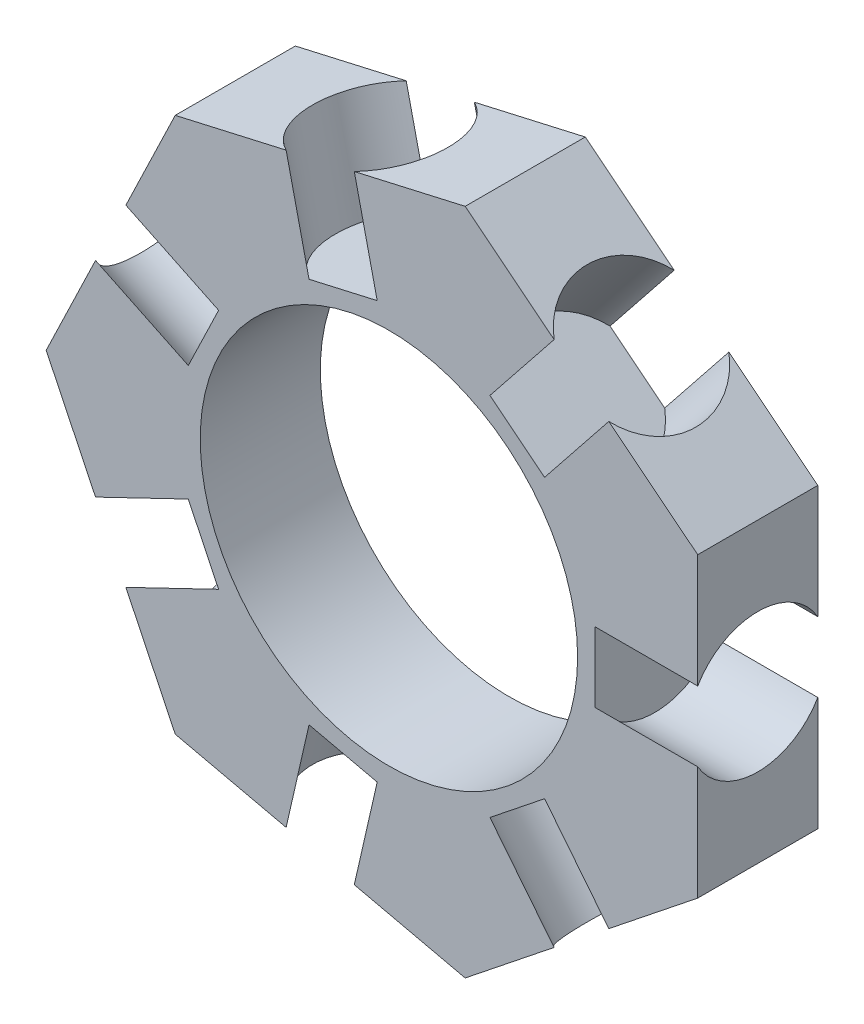
ISO-10303-21;
HEADER;
FILE_DESCRIPTION(('STEP AP214'),'2;1');
FILE_NAME('part.step','',(''),(''),'','','');
FILE_SCHEMA(('AUTOMOTIVE_DESIGN { 1 0 10303 214 1 1 1 1 }'));
ENDSEC;
DATA;
#1=APPLICATION_CONTEXT('core data for automotive mechanical design processes');
#2=APPLICATION_PROTOCOL_DEFINITION('international standard','automotive_design',2000,#1);
#3=PRODUCT_CONTEXT('',#1,'mechanical');
#4=PRODUCT('Part','Part','',(#3));
#5=PRODUCT_RELATED_PRODUCT_CATEGORY('part','',(#4));
#6=PRODUCT_DEFINITION_FORMATION('','',#4);
#7=PRODUCT_DEFINITION_CONTEXT('part definition',#1,'design');
#8=PRODUCT_DEFINITION('design','',#6,#7);
#9=PRODUCT_DEFINITION_SHAPE('','',#8);
#10=(LENGTH_UNIT() NAMED_UNIT(*) SI_UNIT(.MILLI.,.METRE.));
#11=(NAMED_UNIT(*) PLANE_ANGLE_UNIT() SI_UNIT($,.RADIAN.));
#12=(NAMED_UNIT(*) SI_UNIT($,.STERADIAN.) SOLID_ANGLE_UNIT());
#13=UNCERTAINTY_MEASURE_WITH_UNIT(LENGTH_MEASURE(1.E-05),#10,'distance_accuracy_value','');
#14=(GEOMETRIC_REPRESENTATION_CONTEXT(3) GLOBAL_UNCERTAINTY_ASSIGNED_CONTEXT((#13)) GLOBAL_UNIT_ASSIGNED_CONTEXT((#10,
#11,#12)) REPRESENTATION_CONTEXT('',''));
#15=CARTESIAN_POINT('',(0.,0.,0.));
#16=DIRECTION('',(0.,0.,1.));
#17=DIRECTION('',(1.,0.,0.));
#18=AXIS2_PLACEMENT_3D('',#15,#16,#17);
#19=CARTESIAN_POINT('',(4.44563286691441,-19.4775902303136,3.5));
#20=DIRECTION('',(-0.623489801858733,0.78183148246803,0.));
#21=DIRECTION('',(-0.78183148246803,-0.623489801858733,0.));
#22=AXIS2_PLACEMENT_3D('',#19,#20,#21);
#23=PLANE('',#22);
#24=DIRECTION('',(0.78183148246803,0.623489801858733,0.));
#25=VECTOR('',#24,1.);
#26=CARTESIAN_POINT('',(4.44563286691441,-19.4775902303136,3.5));
#27=LINE('',#26,#25);
#28=CARTESIAN_POINT('',(12.8160079125729,-12.8024388764356,3.5));
#29=VERTEX_POINT('',#28);
#30=CARTESIAN_POINT('',(18.,-8.66834313853552,3.5));
#31=VERTEX_POINT('',#30);
#32=EDGE_CURVE('E362',#29,#31,#27,.T.);
#33=ORIENTED_EDGE('',*,*,#32,.F.);
#34=CARTESIAN_POINT('',(11.2228164334572,-14.0729666844245,0.));
#35=DIRECTION('',(-0.623489801858733,0.78183148246803,0.));
#36=DIRECTION('',(-0.78183148246803,-0.623489801858733,0.));
#37=AXIS2_PLACEMENT_3D('',#34,#35,#36);
#38=CIRCLE('',#37,4.05);
#39=CARTESIAN_POINT('',(12.8160079125729,-12.8024388764356,-3.5));
#40=VERTEX_POINT('',#39);
#41=EDGE_CURVE('E488',#29,#40,#38,.T.);
#42=ORIENTED_EDGE('',*,*,#41,.T.);
#43=DIRECTION('',(0.78183148246803,0.623489801858733,0.));
#44=VECTOR('',#43,1.);
#45=CARTESIAN_POINT('',(4.44563286691441,-19.4775902303136,-3.5));
#46=LINE('',#45,#44);
#47=CARTESIAN_POINT('',(18.,-8.66834313853552,-3.5));
#48=VERTEX_POINT('',#47);
#49=EDGE_CURVE('E397',#40,#48,#46,.T.);
#50=ORIENTED_EDGE('',*,*,#49,.T.);
#51=DIRECTION('',(0.,0.,-1.));
#52=VECTOR('',#51,1.);
#53=CARTESIAN_POINT('',(18.,-8.66834313853552,3.5));
#54=LINE('',#53,#52);
#55=EDGE_CURVE('E446',#31,#48,#54,.T.);
#56=ORIENTED_EDGE('',*,*,#55,.F.);
#57=EDGE_LOOP('',(#33,#42,#50,#56));
#58=FACE_BOUND('',#57,.T.);
#59=ADVANCED_FACE('F45',(#58),#23,.F.);
#60=CARTESIAN_POINT('',(18.,-8.66834313853552,3.5));
#61=DIRECTION('',(-1.,0.,0.));
#62=DIRECTION('',(0.,-1.,0.));
#63=AXIS2_PLACEMENT_3D('',#60,#61,#62);
#64=PLANE('',#63);
#65=DIRECTION('',(0.,1.,0.));
#66=VECTOR('',#65,1.);
#67=CARTESIAN_POINT('',(18.,-8.66834313853552,3.5));
#68=LINE('',#67,#66);
#69=CARTESIAN_POINT('',(18.,2.03776838723156,3.5));
#70=VERTEX_POINT('',#69);
#71=CARTESIAN_POINT('',(18.,8.66834313853552,3.5));
#72=VERTEX_POINT('',#71);
#73=EDGE_CURVE('E368',#70,#72,#68,.T.);
#74=ORIENTED_EDGE('',*,*,#73,.F.);
#75=CARTESIAN_POINT('',(18.,0.,0.));
#76=DIRECTION('',(-1.,0.,0.));
#77=DIRECTION('',(0.,-1.,0.));
#78=AXIS2_PLACEMENT_3D('',#75,#76,#77);
#79=CIRCLE('',#78,4.05);
#80=CARTESIAN_POINT('',(18.,2.03776838723156,-3.5));
#81=VERTEX_POINT('',#80);
#82=EDGE_CURVE('E484',#70,#81,#79,.T.);
#83=ORIENTED_EDGE('',*,*,#82,.T.);
#84=DIRECTION('',(0.,1.,0.));
#85=VECTOR('',#84,1.);
#86=CARTESIAN_POINT('',(18.,-8.66834313853552,-3.5));
#87=LINE('',#86,#85);
#88=CARTESIAN_POINT('',(18.,8.66834313853552,-3.5));
#89=VERTEX_POINT('',#88);
#90=EDGE_CURVE('E402',#81,#89,#87,.T.);
#91=ORIENTED_EDGE('',*,*,#90,.T.);
#92=DIRECTION('',(0.,0.,-1.));
#93=VECTOR('',#92,1.);
#94=CARTESIAN_POINT('',(18.,8.66834313853552,3.5));
#95=LINE('',#94,#93);
#96=EDGE_CURVE('E442',#72,#89,#95,.T.);
#97=ORIENTED_EDGE('',*,*,#96,.F.);
#98=EDGE_LOOP('',(#74,#83,#91,#97));
#99=FACE_BOUND('',#98,.T.);
#100=ADVANCED_FACE('F672',(#99),#64,.F.);
#101=CARTESIAN_POINT('',(18.,8.66834313853552,3.5));
#102=DIRECTION('',(-0.623489801858734,-0.78183148246803,0.));
#103=DIRECTION('',(0.78183148246803,-0.623489801858734,0.));
#104=AXIS2_PLACEMENT_3D('',#101,#102,#103);
#105=PLANE('',#104);
#106=DIRECTION('',(-0.78183148246803,0.623489801858734,0.));
#107=VECTOR('',#106,1.);
#108=CARTESIAN_POINT('',(18.,8.66834313853552,3.5));
#109=LINE('',#108,#107);
#110=CARTESIAN_POINT('',(9.62962495434143,15.3434944924135,3.5));
#111=VERTEX_POINT('',#110);
#112=CARTESIAN_POINT('',(4.4456328669144,19.4775902303136,3.5));
#113=VERTEX_POINT('',#112);
#114=EDGE_CURVE('E373',#111,#113,#109,.T.);
#115=ORIENTED_EDGE('',*,*,#114,.F.);
#116=CARTESIAN_POINT('',(11.2228164334571,14.0729666844246,0.));
#117=DIRECTION('',(-0.623489801858734,-0.78183148246803,0.));
#118=DIRECTION('',(0.78183148246803,-0.623489801858734,0.));
#119=AXIS2_PLACEMENT_3D('',#116,#117,#118);
#120=CIRCLE('',#119,4.05);
#121=CARTESIAN_POINT('',(9.62962495434143,15.3434944924135,-3.5));
#122=VERTEX_POINT('',#121);
#123=EDGE_CURVE('E480',#111,#122,#120,.T.);
#124=ORIENTED_EDGE('',*,*,#123,.T.);
#125=DIRECTION('',(-0.78183148246803,0.623489801858734,0.));
#126=VECTOR('',#125,1.);
#127=CARTESIAN_POINT('',(18.,8.66834313853552,-3.5));
#128=LINE('',#127,#126);
#129=CARTESIAN_POINT('',(4.4456328669144,19.4775902303136,-3.5));
#130=VERTEX_POINT('',#129);
#131=EDGE_CURVE('E407',#122,#130,#128,.T.);
#132=ORIENTED_EDGE('',*,*,#131,.T.);
#133=DIRECTION('',(0.,0.,-1.));
#134=VECTOR('',#133,1.);
#135=CARTESIAN_POINT('',(4.4456328669144,19.4775902303136,3.5));
#136=LINE('',#135,#134);
#137=EDGE_CURVE('E438',#113,#130,#136,.T.);
#138=ORIENTED_EDGE('',*,*,#137,.F.);
#139=EDGE_LOOP('',(#115,#124,#132,#138));
#140=FACE_BOUND('',#139,.T.);
#141=ADVANCED_FACE('F737',(#140),#105,.F.);
#142=CARTESIAN_POINT('',(4.4456328669144,19.4775902303136,3.5));
#143=DIRECTION('',(0.222520933956314,-0.974927912181824,0.));
#144=DIRECTION('',(0.974927912181824,0.222520933956314,0.));
#145=AXIS2_PLACEMENT_3D('',#142,#143,#144);
#146=PLANE('',#145);
#147=DIRECTION('',(-0.974927912181824,-0.222520933956314,0.));
#148=VECTOR('',#147,1.);
#149=CARTESIAN_POINT('',(4.4456328669144,19.4775902303136,3.5));
#150=LINE('',#149,#148);
#151=CARTESIAN_POINT('',(-5.99205409048751,17.0952562945594,3.5));
#152=VERTEX_POINT('',#151);
#153=CARTESIAN_POINT('',(-12.4563864893417,15.6198146082321,3.5));
#154=VERTEX_POINT('',#153);
#155=EDGE_CURVE('E378',#152,#154,#150,.T.);
#156=ORIENTED_EDGE('',*,*,#155,.F.);
#157=CARTESIAN_POINT('',(-4.0053768112138,17.5487024192728,0.));
#158=DIRECTION('',(0.222520933956314,-0.974927912181824,0.));
#159=DIRECTION('',(0.974927912181824,0.222520933956314,0.));
#160=AXIS2_PLACEMENT_3D('',#157,#158,#159);
#161=CIRCLE('',#160,4.05);
#162=CARTESIAN_POINT('',(-5.99205409048751,17.0952562945594,-3.5));
#163=VERTEX_POINT('',#162);
#164=EDGE_CURVE('E475',#152,#163,#161,.T.);
#165=ORIENTED_EDGE('',*,*,#164,.T.);
#166=DIRECTION('',(-0.974927912181824,-0.222520933956314,0.));
#167=VECTOR('',#166,1.);
#168=CARTESIAN_POINT('',(4.4456328669144,19.4775902303136,-3.5));
#169=LINE('',#168,#167);
#170=CARTESIAN_POINT('',(-12.4563864893417,15.6198146082321,-3.5));
#171=VERTEX_POINT('',#170);
#172=EDGE_CURVE('E412',#163,#171,#169,.T.);
#173=ORIENTED_EDGE('',*,*,#172,.T.);
#174=DIRECTION('',(0.,0.,-1.));
#175=VECTOR('',#174,1.);
#176=CARTESIAN_POINT('',(-12.4563864893417,15.6198146082321,3.5));
#177=LINE('',#176,#175);
#178=EDGE_CURVE('E434',#154,#171,#177,.T.);
#179=ORIENTED_EDGE('',*,*,#178,.F.);
#180=EDGE_LOOP('',(#156,#165,#173,#179));
#181=FACE_BOUND('',#180,.T.);
#182=ADVANCED_FACE('F723',(#181),#146,.F.);
#183=CARTESIAN_POINT('',(-12.4563864893417,15.6198146082321,3.5));
#184=DIRECTION('',(0.900968867902419,-0.433883739117558,0.));
#185=DIRECTION('',(0.433883739117558,0.900968867902419,0.));
#186=AXIS2_PLACEMENT_3D('',#183,#184,#185);
#187=PLANE('',#186);
#188=DIRECTION('',(-0.433883739117558,-0.900968867902419,0.));
#189=VECTOR('',#188,1.);
#190=CARTESIAN_POINT('',(-12.4563864893417,15.6198146082321,3.5));
#191=LINE('',#190,#189);
#192=CARTESIAN_POINT('',(-17.1015941895512,5.97394142722459,3.5));
#193=VERTEX_POINT('',#192);
#194=CARTESIAN_POINT('',(-19.9784927551454,0.,3.5));
#195=VERTEX_POINT('',#194);
#196=EDGE_CURVE('E383',#193,#195,#191,.T.);
#197=ORIENTED_EDGE('',*,*,#196,.F.);
#198=CARTESIAN_POINT('',(-16.2174396222436,7.80990730411589,0.));
#199=DIRECTION('',(0.900968867902419,-0.433883739117558,0.));
#200=DIRECTION('',(0.433883739117558,0.900968867902419,0.));
#201=AXIS2_PLACEMENT_3D('',#198,#199,#200);
#202=CIRCLE('',#201,4.05);
#203=CARTESIAN_POINT('',(-17.1015941895512,5.97394142722459,-3.5));
#204=VERTEX_POINT('',#203);
#205=EDGE_CURVE('E470',#193,#204,#202,.T.);
#206=ORIENTED_EDGE('',*,*,#205,.T.);
#207=DIRECTION('',(-0.433883739117558,-0.900968867902419,0.));
#208=VECTOR('',#207,1.);
#209=CARTESIAN_POINT('',(-12.4563864893417,15.6198146082321,-3.5));
#210=LINE('',#209,#208);
#211=CARTESIAN_POINT('',(-19.9784927551454,0.,-3.5));
#212=VERTEX_POINT('',#211);
#213=EDGE_CURVE('E417',#204,#212,#210,.T.);
#214=ORIENTED_EDGE('',*,*,#213,.T.);
#215=DIRECTION('',(0.,0.,-1.));
#216=VECTOR('',#215,1.);
#217=CARTESIAN_POINT('',(-19.9784927551454,0.,3.5));
#218=LINE('',#217,#216);
#219=EDGE_CURVE('E430',#195,#212,#218,.T.);
#220=ORIENTED_EDGE('',*,*,#219,.F.);
#221=EDGE_LOOP('',(#197,#206,#214,#220));
#222=FACE_BOUND('',#221,.T.);
#223=ADVANCED_FACE('F715',(#222),#187,.F.);
#224=CARTESIAN_POINT('',(-19.9784927551454,0.,3.5));
#225=DIRECTION('',(0.900968867902419,0.433883739117558,0.));
#226=DIRECTION('',(-0.433883739117558,0.900968867902419,0.));
#227=AXIS2_PLACEMENT_3D('',#224,#225,#226);
#228=PLANE('',#227);
#229=DIRECTION('',(0.433883739117558,-0.900968867902419,0.));
#230=VECTOR('',#229,1.);
#231=CARTESIAN_POINT('',(-19.9784927551454,0.,3.5));
#232=LINE('',#231,#230);
#233=CARTESIAN_POINT('',(-15.3332850549359,-9.64587318100753,3.5));
#234=VERTEX_POINT('',#233);
#235=CARTESIAN_POINT('',(-12.4563864893417,-15.6198146082321,3.5));
#236=VERTEX_POINT('',#235);
#237=EDGE_CURVE('E388',#234,#236,#232,.T.);
#238=ORIENTED_EDGE('',*,*,#237,.F.);
#239=CARTESIAN_POINT('',(-16.2174396222434,-7.80990730411625,0.));
#240=DIRECTION('',(0.900968867902419,0.433883739117558,0.));
#241=DIRECTION('',(-0.433883739117558,0.900968867902419,0.));
#242=AXIS2_PLACEMENT_3D('',#239,#240,#241);
#243=CIRCLE('',#242,4.05);
#244=CARTESIAN_POINT('',(-15.3332850549359,-9.64587318100753,-3.5));
#245=VERTEX_POINT('',#244);
#246=EDGE_CURVE('E280',#234,#245,#243,.T.);
#247=ORIENTED_EDGE('',*,*,#246,.T.);
#248=DIRECTION('',(0.433883739117558,-0.900968867902419,0.));
#249=VECTOR('',#248,1.);
#250=CARTESIAN_POINT('',(-19.9784927551454,0.,-3.5));
#251=LINE('',#250,#249);
#252=CARTESIAN_POINT('',(-12.4563864893417,-15.6198146082321,-3.5));
#253=VERTEX_POINT('',#252);
#254=EDGE_CURVE('E422',#245,#253,#251,.T.);
#255=ORIENTED_EDGE('',*,*,#254,.T.);
#256=DIRECTION('',(0.,0.,-1.));
#257=VECTOR('',#256,1.);
#258=CARTESIAN_POINT('',(-12.4563864893417,-15.6198146082321,3.5));
#259=LINE('',#258,#257);
#260=EDGE_CURVE('E392',#236,#253,#259,.T.);
#261=ORIENTED_EDGE('',*,*,#260,.F.);
#262=EDGE_LOOP('',(#238,#247,#255,#261));
#263=FACE_BOUND('',#262,.T.);
#264=ADVANCED_FACE('F713',(#263),#228,.F.);
#265=CARTESIAN_POINT('',(-12.4563864893417,-15.6198146082321,3.5));
#266=DIRECTION('',(0.222520933956314,0.974927912181824,0.));
#267=DIRECTION('',(-0.974927912181824,0.222520933956314,0.));
#268=AXIS2_PLACEMENT_3D('',#265,#266,#267);
#269=PLANE('',#268);
#270=DIRECTION('',(0.974927912181824,-0.222520933956314,0.));
#271=VECTOR('',#270,1.);
#272=CARTESIAN_POINT('',(-12.4563864893417,-15.6198146082321,3.5));
#273=LINE('',#272,#271);
#274=CARTESIAN_POINT('',(-2.01869953193995,-18.0021485439862,3.5));
#275=VERTEX_POINT('',#274);
#276=CARTESIAN_POINT('',(4.44563286691441,-19.4775902303136,3.5));
#277=VERTEX_POINT('',#276);
#278=EDGE_CURVE('E363',#275,#277,#273,.T.);
#279=ORIENTED_EDGE('',*,*,#278,.F.);
#280=CARTESIAN_POINT('',(-4.00537681121366,-17.5487024192728,0.));
#281=DIRECTION('',(0.222520933956314,0.974927912181824,0.));
#282=DIRECTION('',(-0.974927912181824,0.222520933956314,0.));
#283=AXIS2_PLACEMENT_3D('',#280,#281,#282);
#284=CIRCLE('',#283,4.05);
#285=CARTESIAN_POINT('',(-2.01869953193995,-18.0021485439862,-3.5));
#286=VERTEX_POINT('',#285);
#287=EDGE_CURVE('E458',#275,#286,#284,.T.);
#288=ORIENTED_EDGE('',*,*,#287,.T.);
#289=DIRECTION('',(0.974927912181824,-0.222520933956314,0.));
#290=VECTOR('',#289,1.);
#291=CARTESIAN_POINT('',(-12.4563864893417,-15.6198146082321,-3.5));
#292=LINE('',#291,#290);
#293=CARTESIAN_POINT('',(4.44563286691441,-19.4775902303136,-3.5));
#294=VERTEX_POINT('',#293);
#295=EDGE_CURVE('E354',#286,#294,#292,.T.);
#296=ORIENTED_EDGE('',*,*,#295,.T.);
#297=DIRECTION('',(0.,0.,-1.));
#298=VECTOR('',#297,1.);
#299=CARTESIAN_POINT('',(4.44563286691441,-19.4775902303136,3.5));
#300=LINE('',#299,#298);
#301=EDGE_CURVE('E450',#277,#294,#300,.T.);
#302=ORIENTED_EDGE('',*,*,#301,.F.);
#303=EDGE_LOOP('',(#279,#288,#296,#302));
#304=FACE_BOUND('',#303,.T.);
#305=ADVANCED_FACE('F589',(#304),#269,.F.);
#306=CARTESIAN_POINT('',(0.,0.,3.5));
#307=DIRECTION('',(0.,0.,1.));
#308=DIRECTION('',(1.,0.,0.));
#309=AXIS2_PLACEMENT_3D('',#306,#307,#308);
#310=PLANE('',#309);
#311=DIRECTION('',(1.,0.,0.));
#312=VECTOR('',#311,1.);
#313=CARTESIAN_POINT('',(12.,-2.03776838723143,3.5));
#314=LINE('',#313,#312);
#315=CARTESIAN_POINT('',(12.,-2.03776838723143,3.5));
#316=VERTEX_POINT('',#315);
#317=CARTESIAN_POINT('',(18.,-2.03776838723141,3.5));
#318=VERTEX_POINT('',#317);
#319=EDGE_CURVE('E69',#316,#318,#314,.T.);
#320=ORIENTED_EDGE('',*,*,#319,.F.);
#321=DIRECTION('',(0.,1.,0.));
#322=VECTOR('',#321,1.);
#323=CARTESIAN_POINT('',(12.,0.,3.5));
#324=LINE('',#323,#322);
#325=CARTESIAN_POINT('',(12.,2.03776838723153,3.5));
#326=VERTEX_POINT('',#325);
#327=EDGE_CURVE('E322',#316,#326,#324,.T.);
#328=ORIENTED_EDGE('',*,*,#327,.T.);
#329=DIRECTION('',(1.,0.,0.));
#330=VECTOR('',#329,1.);
#331=CARTESIAN_POINT('',(12.,2.03776838723153,3.5));
#332=LINE('',#331,#330);
#333=EDGE_CURVE('E550',#70,#326,#332,.F.);
#334=ORIENTED_EDGE('',*,*,#333,.F.);
#335=ORIENTED_EDGE('',*,*,#73,.T.);
#336=CARTESIAN_POINT('',(12.8160079125728,12.8024388764357,3.5));
#337=VERTEX_POINT('',#336);
#338=EDGE_CURVE('E374',#72,#337,#109,.T.);
#339=ORIENTED_EDGE('',*,*,#338,.T.);
#340=DIRECTION('',(0.623489801858729,0.781831482468034,0.));
#341=VECTOR('',#340,1.);
#342=CARTESIAN_POINT('',(9.07506910142043,8.11144998162747,3.5));
#343=LINE('',#342,#341);
#344=CARTESIAN_POINT('',(9.07506910142043,8.11144998162747,3.5));
#345=VERTEX_POINT('',#344);
#346=EDGE_CURVE('E539',#345,#337,#343,.T.);
#347=ORIENTED_EDGE('',*,*,#346,.F.);
#348=DIRECTION('',(-0.781831482468034,0.623489801858729,0.));
#349=VECTOR('',#348,1.);
#350=CARTESIAN_POINT('',(7.48187762230474,9.38197778961641,3.5));
#351=LINE('',#350,#349);
#352=CARTESIAN_POINT('',(5.88868614318906,10.6525055976053,3.5));
#353=VERTEX_POINT('',#352);
#354=EDGE_CURVE('E318',#345,#353,#351,.T.);
#355=ORIENTED_EDGE('',*,*,#354,.T.);
#356=DIRECTION('',(0.623489801858729,0.781831482468034,0.));
#357=VECTOR('',#356,1.);
#358=CARTESIAN_POINT('',(5.88868614318906,10.6525055976053,3.5));
#359=LINE('',#358,#357);
#360=EDGE_CURVE('E517',#111,#353,#359,.F.);
#361=ORIENTED_EDGE('',*,*,#360,.F.);
#362=ORIENTED_EDGE('',*,*,#114,.T.);
#363=CARTESIAN_POINT('',(-2.01869953194009,18.0021485439862,3.5));
#364=VERTEX_POINT('',#363);
#365=EDGE_CURVE('E379',#113,#364,#150,.T.);
#366=ORIENTED_EDGE('',*,*,#365,.T.);
#367=DIRECTION('',(-0.222520933956322,0.974927912181822,0.));
#368=VECTOR('',#367,1.);
#369=CARTESIAN_POINT('',(-0.68357392820216,12.1525810708953,3.5));
#370=LINE('',#369,#368);
#371=CARTESIAN_POINT('',(-0.683573928202161,12.1525810708953,3.5));
#372=VERTEX_POINT('',#371);
#373=EDGE_CURVE('E528',#372,#364,#370,.T.);
#374=ORIENTED_EDGE('',*,*,#373,.F.);
#375=DIRECTION('',(-0.974927912181822,-0.222520933956322,0.));
#376=VECTOR('',#375,1.);
#377=CARTESIAN_POINT('',(-2.67025120747587,11.6991349461819,3.5));
#378=LINE('',#377,#376);
#379=CARTESIAN_POINT('',(-4.65692848674957,11.2456888214684,3.5));
#380=VERTEX_POINT('',#379);
#381=EDGE_CURVE('E309',#372,#380,#378,.T.);
#382=ORIENTED_EDGE('',*,*,#381,.T.);
#383=DIRECTION('',(-0.222520933956322,0.974927912181822,0.));
#384=VECTOR('',#383,1.);
#385=CARTESIAN_POINT('',(-4.65692848674957,11.2456888214684,3.5));
#386=LINE('',#385,#384);
#387=EDGE_CURVE('E533',#152,#380,#386,.F.);
#388=ORIENTED_EDGE('',*,*,#387,.F.);
#389=ORIENTED_EDGE('',*,*,#155,.T.);
#390=CARTESIAN_POINT('',(-15.3332850549361,9.64587318100717,3.5));
#391=VERTEX_POINT('',#390);
#392=EDGE_CURVE('E384',#154,#391,#191,.T.);
#393=ORIENTED_EDGE('',*,*,#392,.T.);
#394=DIRECTION('',(-0.900968867902423,0.433883739117549,0.));
#395=VECTOR('',#394,1.);
#396=CARTESIAN_POINT('',(-9.92747184752155,7.04257074630189,3.5));
#397=LINE('',#396,#395);
#398=CARTESIAN_POINT('',(-9.92747184752155,7.04257074630189,3.5));
#399=VERTEX_POINT('',#398);
#400=EDGE_CURVE('E619',#399,#391,#397,.T.);
#401=ORIENTED_EDGE('',*,*,#400,.F.);
#402=DIRECTION('',(-0.433883739117549,-0.900968867902423,0.));
#403=VECTOR('',#402,1.);
#404=CARTESIAN_POINT('',(-10.8116264148291,5.20660486941059,3.5));
#405=LINE('',#404,#403);
#406=CARTESIAN_POINT('',(-11.6957809821366,3.3706389925193,3.5));
#407=VERTEX_POINT('',#406);
#408=EDGE_CURVE('E303',#399,#407,#405,.T.);
#409=ORIENTED_EDGE('',*,*,#408,.T.);
#410=DIRECTION('',(-0.900968867902423,0.433883739117549,0.));
#411=VECTOR('',#410,1.);
#412=CARTESIAN_POINT('',(-11.6957809821366,3.3706389925193,3.5));
#413=LINE('',#412,#411);
#414=EDGE_CURVE('E616',#193,#407,#413,.F.);
#415=ORIENTED_EDGE('',*,*,#414,.F.);
#416=ORIENTED_EDGE('',*,*,#196,.T.);
#417=CARTESIAN_POINT('',(-17.101594189551,-5.97394142722496,3.5));
#418=VERTEX_POINT('',#417);
#419=EDGE_CURVE('E389',#195,#418,#232,.T.);
#420=ORIENTED_EDGE('',*,*,#419,.T.);
#421=DIRECTION('',(-0.900968867902414,-0.433883739117569,0.));
#422=VECTOR('',#421,1.);
#423=CARTESIAN_POINT('',(-11.6957809821365,-3.37063899251956,3.5));
#424=LINE('',#423,#422);
#425=CARTESIAN_POINT('',(-11.6957809821365,-3.37063899251956,3.5));
#426=VERTEX_POINT('',#425);
#427=EDGE_CURVE('E285',#426,#418,#424,.T.);
#428=ORIENTED_EDGE('',*,*,#427,.F.);
#429=DIRECTION('',(0.433883739117569,-0.900968867902414,0.));
#430=VECTOR('',#429,1.);
#431=CARTESIAN_POINT('',(-10.811626414829,-5.20660486941083,3.5));
#432=LINE('',#431,#430);
#433=CARTESIAN_POINT('',(-9.92747184752139,-7.04257074630211,3.5));
#434=VERTEX_POINT('',#433);
#435=EDGE_CURVE('E291',#426,#434,#432,.T.);
#436=ORIENTED_EDGE('',*,*,#435,.T.);
#437=DIRECTION('',(-0.900968867902414,-0.433883739117569,0.));
#438=VECTOR('',#437,1.);
#439=CARTESIAN_POINT('',(-9.92747184752139,-7.04257074630211,3.5));
#440=LINE('',#439,#438);
#441=EDGE_CURVE('E274',#234,#434,#440,.F.);
#442=ORIENTED_EDGE('',*,*,#441,.F.);
#443=ORIENTED_EDGE('',*,*,#237,.T.);
#444=CARTESIAN_POINT('',(-5.99205409048737,-17.0952562945594,3.5));
#445=VERTEX_POINT('',#444);
#446=EDGE_CURVE('E358',#236,#445,#273,.T.);
#447=ORIENTED_EDGE('',*,*,#446,.T.);
#448=DIRECTION('',(-0.222520933956314,-0.974927912181824,0.));
#449=VECTOR('',#448,1.);
#450=CARTESIAN_POINT('',(-4.65692848674948,-11.2456888214685,3.5));
#451=LINE('',#450,#449);
#452=CARTESIAN_POINT('',(-4.65692848674948,-11.2456888214685,3.5));
#453=VERTEX_POINT('',#452);
#454=EDGE_CURVE('E342',#453,#445,#451,.T.);
#455=ORIENTED_EDGE('',*,*,#454,.F.);
#456=DIRECTION('',(0.974927912181824,-0.222520933956314,0.));
#457=VECTOR('',#456,1.);
#458=CARTESIAN_POINT('',(-2.67025120747577,-11.6991349461819,3.5));
#459=LINE('',#458,#457);
#460=CARTESIAN_POINT('',(-0.683573928202061,-12.1525810708953,3.5));
#461=VERTEX_POINT('',#460);
#462=EDGE_CURVE('E345',#453,#461,#459,.T.);
#463=ORIENTED_EDGE('',*,*,#462,.T.);
#464=DIRECTION('',(-0.222520933956314,-0.974927912181824,0.));
#465=VECTOR('',#464,1.);
#466=CARTESIAN_POINT('',(-0.683573928202061,-12.1525810708953,3.5));
#467=LINE('',#466,#465);
#468=EDGE_CURVE('E339',#275,#461,#467,.F.);
#469=ORIENTED_EDGE('',*,*,#468,.F.);
#470=ORIENTED_EDGE('',*,*,#278,.T.);
#471=CARTESIAN_POINT('',(9.62962495434156,-15.3434944924135,3.5));
#472=VERTEX_POINT('',#471);
#473=EDGE_CURVE('E364',#277,#472,#27,.T.);
#474=ORIENTED_EDGE('',*,*,#473,.T.);
#475=DIRECTION('',(0.623489801858735,-0.781831482468028,0.));
#476=VECTOR('',#475,1.);
#477=CARTESIAN_POINT('',(5.88868614318915,-10.6525055976053,3.5));
#478=LINE('',#477,#476);
#479=CARTESIAN_POINT('',(5.88868614318915,-10.6525055976053,3.5));
#480=VERTEX_POINT('',#479);
#481=EDGE_CURVE('E61',#480,#472,#478,.T.);
#482=ORIENTED_EDGE('',*,*,#481,.F.);
#483=DIRECTION('',(0.781831482468029,0.623489801858735,0.));
#484=VECTOR('',#483,1.);
#485=CARTESIAN_POINT('',(7.48187762230482,-9.38197778961634,3.5));
#486=LINE('',#485,#484);
#487=CARTESIAN_POINT('',(9.0750691014205,-8.11144998162739,3.5));
#488=VERTEX_POINT('',#487);
#489=EDGE_CURVE('E304',#480,#488,#486,.T.);
#490=ORIENTED_EDGE('',*,*,#489,.T.);
#491=DIRECTION('',(0.623489801858735,-0.781831482468028,0.));
#492=VECTOR('',#491,1.);
#493=CARTESIAN_POINT('',(9.0750691014205,-8.11144998162739,3.5));
#494=LINE('',#493,#492);
#495=EDGE_CURVE('E563',#29,#488,#494,.F.);
#496=ORIENTED_EDGE('',*,*,#495,.F.);
#497=ORIENTED_EDGE('',*,*,#32,.T.);
#498=EDGE_CURVE('E369',#31,#318,#68,.T.);
#499=ORIENTED_EDGE('',*,*,#498,.T.);
#500=EDGE_LOOP('',(#320,#328,#334,#335,#339,#347,#355,#361,#362,#366,#374,#382,#388,#389,#393,
#401,#409,#415,#416,#420,#428,#436,#442,#443,#447,#455,#463,#469,#470,#474,#482,#490,#496,#497,#499));
#501=FACE_BOUND('',#500,.T.);
#502=CARTESIAN_POINT('',(0.,0.,3.5));
#503=DIRECTION('',(0.,0.,1.));
#504=DIRECTION('',(1.,0.,0.));
#505=AXIS2_PLACEMENT_3D('',#502,#503,#504);
#506=CIRCLE('',#505,11.);
#507=CARTESIAN_POINT('',(11.,0.,3.5));
#508=VERTEX_POINT('',#507);
#509=EDGE_CURVE('E350',#508,#508,#506,.T.);
#510=ORIENTED_EDGE('',*,*,#509,.F.);
#511=EDGE_LOOP('',(#510));
#512=FACE_BOUND('',#511,.T.);
#513=ADVANCED_FACE('F299',(#501,#512),#310,.T.);
#514=CARTESIAN_POINT('',(0.,0.,-3.5));
#515=DIRECTION('',(0.,0.,1.));
#516=DIRECTION('',(1.,0.,0.));
#517=AXIS2_PLACEMENT_3D('',#514,#515,#516);
#518=PLANE('',#517);
#519=DIRECTION('',(0.,1.,0.));
#520=VECTOR('',#519,1.);
#521=CARTESIAN_POINT('',(12.,0.,-3.5));
#522=LINE('',#521,#520);
#523=CARTESIAN_POINT('',(12.,-2.03776838723143,-3.5));
#524=VERTEX_POINT('',#523);
#525=CARTESIAN_POINT('',(12.,2.03776838723153,-3.5));
#526=VERTEX_POINT('',#525);
#527=EDGE_CURVE('E11',#524,#526,#522,.T.);
#528=ORIENTED_EDGE('',*,*,#527,.F.);
#529=DIRECTION('',(1.,0.,0.));
#530=VECTOR('',#529,1.);
#531=CARTESIAN_POINT('',(12.,-2.03776838723143,-3.5));
#532=LINE('',#531,#530);
#533=CARTESIAN_POINT('',(18.,-2.03776838723141,-3.5));
#534=VERTEX_POINT('',#533);
#535=EDGE_CURVE('E546',#524,#534,#532,.T.);
#536=ORIENTED_EDGE('',*,*,#535,.T.);
#537=EDGE_CURVE('E403',#48,#534,#87,.T.);
#538=ORIENTED_EDGE('',*,*,#537,.F.);
#539=ORIENTED_EDGE('',*,*,#49,.F.);
#540=DIRECTION('',(0.623489801858735,-0.781831482468028,0.));
#541=VECTOR('',#540,1.);
#542=CARTESIAN_POINT('',(9.0750691014205,-8.11144998162739,-3.5));
#543=LINE('',#542,#541);
#544=CARTESIAN_POINT('',(9.0750691014205,-8.11144998162739,-3.5));
#545=VERTEX_POINT('',#544);
#546=EDGE_CURVE('E555',#40,#545,#543,.F.);
#547=ORIENTED_EDGE('',*,*,#546,.T.);
#548=DIRECTION('',(0.781831482468029,0.623489801858735,0.));
#549=VECTOR('',#548,1.);
#550=CARTESIAN_POINT('',(7.48187762230482,-9.38197778961634,-3.5));
#551=LINE('',#550,#549);
#552=CARTESIAN_POINT('',(5.88868614318915,-10.6525055976053,-3.5));
#553=VERTEX_POINT('',#552);
#554=EDGE_CURVE('E489',#553,#545,#551,.T.);
#555=ORIENTED_EDGE('',*,*,#554,.F.);
#556=DIRECTION('',(0.623489801858735,-0.781831482468028,0.));
#557=VECTOR('',#556,1.);
#558=CARTESIAN_POINT('',(5.88868614318915,-10.6525055976053,-3.5));
#559=LINE('',#558,#557);
#560=CARTESIAN_POINT('',(9.62962495434156,-15.3434944924135,-3.5));
#561=VERTEX_POINT('',#560);
#562=EDGE_CURVE('E559',#553,#561,#559,.T.);
#563=ORIENTED_EDGE('',*,*,#562,.T.);
#564=EDGE_CURVE('E398',#294,#561,#46,.T.);
#565=ORIENTED_EDGE('',*,*,#564,.F.);
#566=ORIENTED_EDGE('',*,*,#295,.F.);
#567=DIRECTION('',(-0.222520933956314,-0.974927912181824,0.));
#568=VECTOR('',#567,1.);
#569=CARTESIAN_POINT('',(-0.683573928202061,-12.1525810708953,-3.5));
#570=LINE('',#569,#568);
#571=CARTESIAN_POINT('',(-0.683573928202061,-12.1525810708953,-3.5));
#572=VERTEX_POINT('',#571);
#573=EDGE_CURVE('E331',#286,#572,#570,.F.);
#574=ORIENTED_EDGE('',*,*,#573,.T.);
#575=DIRECTION('',(0.974927912181824,-0.222520933956314,0.));
#576=VECTOR('',#575,1.);
#577=CARTESIAN_POINT('',(-2.67025120747577,-11.6991349461819,-3.5));
#578=LINE('',#577,#576);
#579=CARTESIAN_POINT('',(-4.65692848674948,-11.2456888214685,-3.5));
#580=VERTEX_POINT('',#579);
#581=EDGE_CURVE('E459',#580,#572,#578,.T.);
#582=ORIENTED_EDGE('',*,*,#581,.F.);
#583=DIRECTION('',(-0.222520933956314,-0.974927912181824,0.));
#584=VECTOR('',#583,1.);
#585=CARTESIAN_POINT('',(-4.65692848674948,-11.2456888214685,-3.5));
#586=LINE('',#585,#584);
#587=CARTESIAN_POINT('',(-5.99205409048737,-17.0952562945594,-3.5));
#588=VERTEX_POINT('',#587);
#589=EDGE_CURVE('E335',#580,#588,#586,.T.);
#590=ORIENTED_EDGE('',*,*,#589,.T.);
#591=EDGE_CURVE('E393',#253,#588,#292,.T.);
#592=ORIENTED_EDGE('',*,*,#591,.F.);
#593=ORIENTED_EDGE('',*,*,#254,.F.);
#594=DIRECTION('',(-0.900968867902414,-0.433883739117569,0.));
#595=VECTOR('',#594,1.);
#596=CARTESIAN_POINT('',(-9.92747184752139,-7.04257074630211,-3.5));
#597=LINE('',#596,#595);
#598=CARTESIAN_POINT('',(-9.92747184752139,-7.04257074630211,-3.5));
#599=VERTEX_POINT('',#598);
#600=EDGE_CURVE('E596',#245,#599,#597,.F.);
#601=ORIENTED_EDGE('',*,*,#600,.T.);
#602=DIRECTION('',(0.433883739117569,-0.900968867902414,0.));
#603=VECTOR('',#602,1.);
#604=CARTESIAN_POINT('',(-10.811626414829,-5.20660486941083,-3.5));
#605=LINE('',#604,#603);
#606=CARTESIAN_POINT('',(-11.6957809821365,-3.37063899251956,-3.5));
#607=VERTEX_POINT('',#606);
#608=EDGE_CURVE('E294',#607,#599,#605,.T.);
#609=ORIENTED_EDGE('',*,*,#608,.F.);
#610=DIRECTION('',(-0.900968867902414,-0.433883739117569,0.));
#611=VECTOR('',#610,1.);
#612=CARTESIAN_POINT('',(-11.6957809821365,-3.37063899251956,-3.5));
#613=LINE('',#612,#611);
#614=CARTESIAN_POINT('',(-17.101594189551,-5.97394142722497,-3.5));
#615=VERTEX_POINT('',#614);
#616=EDGE_CURVE('E286',#607,#615,#613,.T.);
#617=ORIENTED_EDGE('',*,*,#616,.T.);
#618=EDGE_CURVE('E423',#212,#615,#251,.T.);
#619=ORIENTED_EDGE('',*,*,#618,.F.);
#620=ORIENTED_EDGE('',*,*,#213,.F.);
#621=DIRECTION('',(-0.900968867902423,0.433883739117549,0.));
#622=VECTOR('',#621,1.);
#623=CARTESIAN_POINT('',(-11.6957809821366,3.3706389925193,-3.5));
#624=LINE('',#623,#622);
#625=CARTESIAN_POINT('',(-11.6957809821366,3.3706389925193,-3.5));
#626=VERTEX_POINT('',#625);
#627=EDGE_CURVE('E608',#204,#626,#624,.F.);
#628=ORIENTED_EDGE('',*,*,#627,.T.);
#629=DIRECTION('',(-0.433883739117549,-0.900968867902423,0.));
#630=VECTOR('',#629,1.);
#631=CARTESIAN_POINT('',(-10.8116264148291,5.20660486941059,-3.5));
#632=LINE('',#631,#630);
#633=CARTESIAN_POINT('',(-9.92747184752155,7.04257074630189,-3.5));
#634=VERTEX_POINT('',#633);
#635=EDGE_CURVE('E494',#634,#626,#632,.T.);
#636=ORIENTED_EDGE('',*,*,#635,.F.);
#637=DIRECTION('',(-0.900968867902423,0.433883739117549,0.));
#638=VECTOR('',#637,1.);
#639=CARTESIAN_POINT('',(-9.92747184752155,7.04257074630189,-3.5));
#640=LINE('',#639,#638);
#641=CARTESIAN_POINT('',(-15.3332850549361,9.64587318100719,-3.5));
#642=VERTEX_POINT('',#641);
#643=EDGE_CURVE('E612',#634,#642,#640,.T.);
#644=ORIENTED_EDGE('',*,*,#643,.T.);
#645=EDGE_CURVE('E418',#171,#642,#210,.T.);
#646=ORIENTED_EDGE('',*,*,#645,.F.);
#647=ORIENTED_EDGE('',*,*,#172,.F.);
#648=DIRECTION('',(-0.222520933956322,0.974927912181822,0.));
#649=VECTOR('',#648,1.);
#650=CARTESIAN_POINT('',(-4.65692848674957,11.2456888214684,-3.5));
#651=LINE('',#650,#649);
#652=CARTESIAN_POINT('',(-4.65692848674957,11.2456888214684,-3.5));
#653=VERTEX_POINT('',#652);
#654=EDGE_CURVE('E622',#163,#653,#651,.F.);
#655=ORIENTED_EDGE('',*,*,#654,.T.);
#656=DIRECTION('',(-0.974927912181822,-0.222520933956322,0.));
#657=VECTOR('',#656,1.);
#658=CARTESIAN_POINT('',(-2.67025120747587,11.6991349461819,-3.5));
#659=LINE('',#658,#657);
#660=CARTESIAN_POINT('',(-0.683573928202161,12.1525810708953,-3.5));
#661=VERTEX_POINT('',#660);
#662=EDGE_CURVE('E497',#661,#653,#659,.T.);
#663=ORIENTED_EDGE('',*,*,#662,.F.);
#664=DIRECTION('',(-0.222520933956322,0.974927912181822,0.));
#665=VECTOR('',#664,1.);
#666=CARTESIAN_POINT('',(-0.68357392820216,12.1525810708953,-3.5));
#667=LINE('',#666,#665);
#668=CARTESIAN_POINT('',(-2.0186995319401,18.0021485439862,-3.5));
#669=VERTEX_POINT('',#668);
#670=EDGE_CURVE('E626',#661,#669,#667,.T.);
#671=ORIENTED_EDGE('',*,*,#670,.T.);
#672=EDGE_CURVE('E413',#130,#669,#169,.T.);
#673=ORIENTED_EDGE('',*,*,#672,.F.);
#674=ORIENTED_EDGE('',*,*,#131,.F.);
#675=DIRECTION('',(0.623489801858729,0.781831482468034,0.));
#676=VECTOR('',#675,1.);
#677=CARTESIAN_POINT('',(5.88868614318906,10.6525055976053,-3.5));
#678=LINE('',#677,#676);
#679=CARTESIAN_POINT('',(5.88868614318906,10.6525055976053,-3.5));
#680=VERTEX_POINT('',#679);
#681=EDGE_CURVE('E514',#122,#680,#678,.F.);
#682=ORIENTED_EDGE('',*,*,#681,.T.);
#683=DIRECTION('',(-0.781831482468034,0.623489801858729,0.));
#684=VECTOR('',#683,1.);
#685=CARTESIAN_POINT('',(7.48187762230474,9.38197778961641,-3.5));
#686=LINE('',#685,#684);
#687=CARTESIAN_POINT('',(9.07506910142043,8.11144998162747,-3.5));
#688=VERTEX_POINT('',#687);
#689=EDGE_CURVE('E54',#688,#680,#686,.T.);
#690=ORIENTED_EDGE('',*,*,#689,.F.);
#691=DIRECTION('',(0.623489801858729,0.781831482468034,0.));
#692=VECTOR('',#691,1.);
#693=CARTESIAN_POINT('',(9.07506910142043,8.11144998162747,-3.5));
#694=LINE('',#693,#692);
#695=CARTESIAN_POINT('',(12.8160079125728,12.8024388764357,-3.5));
#696=VERTEX_POINT('',#695);
#697=EDGE_CURVE('E527',#688,#696,#694,.T.);
#698=ORIENTED_EDGE('',*,*,#697,.T.);
#699=EDGE_CURVE('E408',#89,#696,#128,.T.);
#700=ORIENTED_EDGE('',*,*,#699,.F.);
#701=ORIENTED_EDGE('',*,*,#90,.F.);
#702=DIRECTION('',(1.,0.,0.));
#703=VECTOR('',#702,1.);
#704=CARTESIAN_POINT('',(12.,2.03776838723153,-3.5));
#705=LINE('',#704,#703);
#706=EDGE_CURVE('E542',#81,#526,#705,.F.);
#707=ORIENTED_EDGE('',*,*,#706,.T.);
#708=EDGE_LOOP('',(#528,#536,#538,#539,#547,#555,#563,#565,#566,#574,#582,#590,#592,#593,#601,
#609,#617,#619,#620,#628,#636,#644,#646,#647,#655,#663,#671,#673,#674,#682,#690,#698,#700,#701,#707));
#709=FACE_BOUND('',#708,.T.);
#710=CARTESIAN_POINT('',(0.,0.,-3.5));
#711=DIRECTION('',(0.,0.,1.));
#712=DIRECTION('',(1.,0.,0.));
#713=AXIS2_PLACEMENT_3D('',#710,#711,#712);
#714=CIRCLE('',#713,11.);
#715=CARTESIAN_POINT('',(11.,0.,-3.5));
#716=VERTEX_POINT('',#715);
#717=EDGE_CURVE('E349',#716,#716,#714,.T.);
#718=ORIENTED_EDGE('',*,*,#717,.T.);
#719=EDGE_LOOP('',(#718));
#720=FACE_BOUND('',#719,.T.);
#721=ADVANCED_FACE('F523',(#709,#720),#518,.F.);
#722=ORIENTED_EDGE('',*,*,#591,.T.);
#723=EDGE_CURVE('E454',#588,#445,#284,.T.);
#724=ORIENTED_EDGE('',*,*,#723,.T.);
#725=ORIENTED_EDGE('',*,*,#446,.F.);
#726=ORIENTED_EDGE('',*,*,#260,.T.);
#727=EDGE_LOOP('',(#722,#724,#725,#726));
#728=FACE_BOUND('',#727,.T.);
#729=ADVANCED_FACE('F47',(#728),#269,.F.);
#730=ORIENTED_EDGE('',*,*,#564,.T.);
#731=EDGE_CURVE('E485',#561,#472,#38,.T.);
#732=ORIENTED_EDGE('',*,*,#731,.T.);
#733=ORIENTED_EDGE('',*,*,#473,.F.);
#734=ORIENTED_EDGE('',*,*,#301,.T.);
#735=EDGE_LOOP('',(#730,#732,#733,#734));
#736=FACE_BOUND('',#735,.T.);
#737=ADVANCED_FACE('F587',(#736),#23,.F.);
#738=ORIENTED_EDGE('',*,*,#537,.T.);
#739=EDGE_CURVE('E481',#534,#318,#79,.T.);
#740=ORIENTED_EDGE('',*,*,#739,.T.);
#741=ORIENTED_EDGE('',*,*,#498,.F.);
#742=ORIENTED_EDGE('',*,*,#55,.T.);
#743=EDGE_LOOP('',(#738,#740,#741,#742));
#744=FACE_BOUND('',#743,.T.);
#745=ADVANCED_FACE('F739',(#744),#64,.F.);
#746=ORIENTED_EDGE('',*,*,#699,.T.);
#747=EDGE_CURVE('E476',#696,#337,#120,.T.);
#748=ORIENTED_EDGE('',*,*,#747,.T.);
#749=ORIENTED_EDGE('',*,*,#338,.F.);
#750=ORIENTED_EDGE('',*,*,#96,.T.);
#751=EDGE_LOOP('',(#746,#748,#749,#750));
#752=FACE_BOUND('',#751,.T.);
#753=ADVANCED_FACE('F745',(#752),#105,.F.);
#754=ORIENTED_EDGE('',*,*,#672,.T.);
#755=EDGE_CURVE('E471',#669,#364,#161,.T.);
#756=ORIENTED_EDGE('',*,*,#755,.T.);
#757=ORIENTED_EDGE('',*,*,#365,.F.);
#758=ORIENTED_EDGE('',*,*,#137,.T.);
#759=EDGE_LOOP('',(#754,#756,#757,#758));
#760=FACE_BOUND('',#759,.T.);
#761=ADVANCED_FACE('F650',(#760),#146,.F.);
#762=ORIENTED_EDGE('',*,*,#645,.T.);
#763=EDGE_CURVE('E466',#642,#391,#202,.T.);
#764=ORIENTED_EDGE('',*,*,#763,.T.);
#765=ORIENTED_EDGE('',*,*,#392,.F.);
#766=ORIENTED_EDGE('',*,*,#178,.T.);
#767=EDGE_LOOP('',(#762,#764,#765,#766));
#768=FACE_BOUND('',#767,.T.);
#769=ADVANCED_FACE('F726',(#768),#187,.F.);
#770=ORIENTED_EDGE('',*,*,#618,.T.);
#771=EDGE_CURVE('E462',#615,#418,#243,.T.);
#772=ORIENTED_EDGE('',*,*,#771,.T.);
#773=ORIENTED_EDGE('',*,*,#419,.F.);
#774=ORIENTED_EDGE('',*,*,#219,.T.);
#775=EDGE_LOOP('',(#770,#772,#773,#774));
#776=FACE_BOUND('',#775,.T.);
#777=ADVANCED_FACE('F717',(#776),#228,.F.);
#778=CARTESIAN_POINT('',(0.,0.,3.5));
#779=DIRECTION('',(0.,0.,-1.));
#780=DIRECTION('',(-1.,0.,0.));
#781=AXIS2_PLACEMENT_3D('',#778,#779,#780);
#782=CYLINDRICAL_SURFACE('',#781,11.);
#783=ORIENTED_EDGE('',*,*,#509,.T.);
#784=EDGE_LOOP('',(#783));
#785=FACE_BOUND('',#784,.T.);
#786=ORIENTED_EDGE('',*,*,#717,.F.);
#787=EDGE_LOOP('',(#786));
#788=FACE_BOUND('',#787,.T.);
#789=ADVANCED_FACE('F729',(#785,#788),#782,.F.);
#790=CARTESIAN_POINT('',(-2.67025120747577,-11.6991349461819,0.));
#791=DIRECTION('',(-0.222520933956314,-0.974927912181824,0.));
#792=DIRECTION('',(0.974927912181824,-0.222520933956314,0.));
#793=AXIS2_PLACEMENT_3D('',#790,#791,#792);
#794=PLANE('',#793);
#795=CARTESIAN_POINT('',(-2.67025120747577,-11.6991349461819,0.));
#796=DIRECTION('',(-0.222520933956314,-0.974927912181824,0.));
#797=DIRECTION('',(0.974927912181824,-0.222520933956314,0.));
#798=AXIS2_PLACEMENT_3D('',#795,#796,#797);
#799=CIRCLE('',#798,4.05);
#800=EDGE_CURVE('E330',#453,#580,#799,.T.);
#801=ORIENTED_EDGE('',*,*,#800,.T.);
#802=ORIENTED_EDGE('',*,*,#581,.T.);
#803=EDGE_CURVE('E326',#572,#461,#799,.T.);
#804=ORIENTED_EDGE('',*,*,#803,.T.);
#805=ORIENTED_EDGE('',*,*,#462,.F.);
#806=EDGE_LOOP('',(#801,#802,#804,#805));
#807=FACE_BOUND('',#806,.T.);
#808=ADVANCED_FACE('F700',(#807),#794,.T.);
#809=CARTESIAN_POINT('',(-2.67025120747577,-11.6991349461819,0.));
#810=DIRECTION('',(-0.222520933956314,-0.974927912181824,0.));
#811=DIRECTION('',(0.974927912181824,-0.222520933956314,0.));
#812=AXIS2_PLACEMENT_3D('',#809,#810,#811);
#813=CYLINDRICAL_SURFACE('',#812,4.05);
#814=ORIENTED_EDGE('',*,*,#454,.T.);
#815=ORIENTED_EDGE('',*,*,#723,.F.);
#816=ORIENTED_EDGE('',*,*,#589,.F.);
#817=ORIENTED_EDGE('',*,*,#800,.F.);
#818=EDGE_LOOP('',(#814,#815,#816,#817));
#819=FACE_BOUND('',#818,.T.);
#820=ADVANCED_FACE('F708',(#819),#813,.F.);
#821=ORIENTED_EDGE('',*,*,#468,.T.);
#822=ORIENTED_EDGE('',*,*,#803,.F.);
#823=ORIENTED_EDGE('',*,*,#573,.F.);
#824=ORIENTED_EDGE('',*,*,#287,.F.);
#825=EDGE_LOOP('',(#821,#822,#823,#824));
#826=FACE_BOUND('',#825,.T.);
#827=ADVANCED_FACE('F706',(#826),#813,.F.);
#828=CARTESIAN_POINT('',(-10.811626414829,-5.20660486941083,0.));
#829=DIRECTION('',(-0.900968867902414,-0.433883739117569,0.));
#830=DIRECTION('',(0.433883739117569,-0.900968867902414,0.));
#831=AXIS2_PLACEMENT_3D('',#828,#829,#830);
#832=PLANE('',#831);
#833=CARTESIAN_POINT('',(-10.811626414829,-5.20660486941083,0.));
#834=DIRECTION('',(-0.900968867902414,-0.433883739117569,0.));
#835=DIRECTION('',(0.433883739117569,-0.900968867902414,0.));
#836=AXIS2_PLACEMENT_3D('',#833,#834,#835);
#837=CIRCLE('',#836,4.05);
#838=EDGE_CURVE('E296',#426,#607,#837,.T.);
#839=ORIENTED_EDGE('',*,*,#838,.T.);
#840=ORIENTED_EDGE('',*,*,#608,.T.);
#841=EDGE_CURVE('E277',#599,#434,#837,.T.);
#842=ORIENTED_EDGE('',*,*,#841,.T.);
#843=ORIENTED_EDGE('',*,*,#435,.F.);
#844=EDGE_LOOP('',(#839,#840,#842,#843));
#845=FACE_BOUND('',#844,.T.);
#846=ADVANCED_FACE('F290',(#845),#832,.T.);
#847=CARTESIAN_POINT('',(-10.811626414829,-5.20660486941083,0.));
#848=DIRECTION('',(-0.900968867902414,-0.433883739117569,0.));
#849=DIRECTION('',(0.433883739117569,-0.900968867902414,0.));
#850=AXIS2_PLACEMENT_3D('',#847,#848,#849);
#851=CYLINDRICAL_SURFACE('',#850,4.05);
#852=ORIENTED_EDGE('',*,*,#427,.T.);
#853=ORIENTED_EDGE('',*,*,#771,.F.);
#854=ORIENTED_EDGE('',*,*,#616,.F.);
#855=ORIENTED_EDGE('',*,*,#838,.F.);
#856=EDGE_LOOP('',(#852,#853,#854,#855));
#857=FACE_BOUND('',#856,.T.);
#858=ADVANCED_FACE('F789',(#857),#851,.F.);
#859=ORIENTED_EDGE('',*,*,#441,.T.);
#860=ORIENTED_EDGE('',*,*,#841,.F.);
#861=ORIENTED_EDGE('',*,*,#600,.F.);
#862=ORIENTED_EDGE('',*,*,#246,.F.);
#863=EDGE_LOOP('',(#859,#860,#861,#862));
#864=FACE_BOUND('',#863,.T.);
#865=ADVANCED_FACE('F276',(#864),#851,.F.);
#866=CARTESIAN_POINT('',(-10.8116264148291,5.20660486941059,0.));
#867=DIRECTION('',(-0.900968867902423,0.433883739117549,0.));
#868=DIRECTION('',(-0.433883739117549,-0.900968867902423,0.));
#869=AXIS2_PLACEMENT_3D('',#866,#867,#868);
#870=PLANE('',#869);
#871=CARTESIAN_POINT('',(-10.8116264148291,5.20660486941059,0.));
#872=DIRECTION('',(-0.900968867902423,0.433883739117549,0.));
#873=DIRECTION('',(-0.433883739117549,-0.900968867902423,0.));
#874=AXIS2_PLACEMENT_3D('',#871,#872,#873);
#875=CIRCLE('',#874,4.05);
#876=EDGE_CURVE('E644',#399,#634,#875,.T.);
#877=ORIENTED_EDGE('',*,*,#876,.T.);
#878=ORIENTED_EDGE('',*,*,#635,.T.);
#879=EDGE_CURVE('E600',#626,#407,#875,.T.);
#880=ORIENTED_EDGE('',*,*,#879,.T.);
#881=ORIENTED_EDGE('',*,*,#408,.F.);
#882=EDGE_LOOP('',(#877,#878,#880,#881));
#883=FACE_BOUND('',#882,.T.);
#884=ADVANCED_FACE('F769',(#883),#870,.T.);
#885=CARTESIAN_POINT('',(-10.8116264148291,5.20660486941059,0.));
#886=DIRECTION('',(-0.900968867902423,0.433883739117549,0.));
#887=DIRECTION('',(-0.433883739117549,-0.900968867902423,0.));
#888=AXIS2_PLACEMENT_3D('',#885,#886,#887);
#889=CYLINDRICAL_SURFACE('',#888,4.05);
#890=ORIENTED_EDGE('',*,*,#400,.T.);
#891=ORIENTED_EDGE('',*,*,#763,.F.);
#892=ORIENTED_EDGE('',*,*,#643,.F.);
#893=ORIENTED_EDGE('',*,*,#876,.F.);
#894=EDGE_LOOP('',(#890,#891,#892,#893));
#895=FACE_BOUND('',#894,.T.);
#896=ADVANCED_FACE('F765',(#895),#889,.F.);
#897=ORIENTED_EDGE('',*,*,#414,.T.);
#898=ORIENTED_EDGE('',*,*,#879,.F.);
#899=ORIENTED_EDGE('',*,*,#627,.F.);
#900=ORIENTED_EDGE('',*,*,#205,.F.);
#901=EDGE_LOOP('',(#897,#898,#899,#900));
#902=FACE_BOUND('',#901,.T.);
#903=ADVANCED_FACE('F768',(#902),#889,.F.);
#904=CARTESIAN_POINT('',(-2.67025120747587,11.6991349461819,0.));
#905=DIRECTION('',(-0.222520933956322,0.974927912181822,0.));
#906=DIRECTION('',(-0.974927912181822,-0.222520933956322,0.));
#907=AXIS2_PLACEMENT_3D('',#904,#905,#906);
#908=PLANE('',#907);
#909=CARTESIAN_POINT('',(-2.67025120747587,11.6991349461819,0.));
#910=DIRECTION('',(-0.222520933956322,0.974927912181822,0.));
#911=DIRECTION('',(-0.974927912181822,-0.222520933956322,0.));
#912=AXIS2_PLACEMENT_3D('',#909,#910,#911);
#913=CIRCLE('',#912,4.05);
#914=EDGE_CURVE('E519',#372,#661,#913,.T.);
#915=ORIENTED_EDGE('',*,*,#914,.T.);
#916=ORIENTED_EDGE('',*,*,#662,.T.);
#917=EDGE_CURVE('E635',#653,#380,#913,.T.);
#918=ORIENTED_EDGE('',*,*,#917,.T.);
#919=ORIENTED_EDGE('',*,*,#381,.F.);
#920=EDGE_LOOP('',(#915,#916,#918,#919));
#921=FACE_BOUND('',#920,.T.);
#922=ADVANCED_FACE('F640',(#921),#908,.T.);
#923=CARTESIAN_POINT('',(-2.67025120747587,11.6991349461819,0.));
#924=DIRECTION('',(-0.222520933956322,0.974927912181822,0.));
#925=DIRECTION('',(-0.974927912181822,-0.222520933956322,0.));
#926=AXIS2_PLACEMENT_3D('',#923,#924,#925);
#927=CYLINDRICAL_SURFACE('',#926,4.05);
#928=ORIENTED_EDGE('',*,*,#373,.T.);
#929=ORIENTED_EDGE('',*,*,#755,.F.);
#930=ORIENTED_EDGE('',*,*,#670,.F.);
#931=ORIENTED_EDGE('',*,*,#914,.F.);
#932=EDGE_LOOP('',(#928,#929,#930,#931));
#933=FACE_BOUND('',#932,.T.);
#934=ADVANCED_FACE('F648',(#933),#927,.F.);
#935=ORIENTED_EDGE('',*,*,#387,.T.);
#936=ORIENTED_EDGE('',*,*,#917,.F.);
#937=ORIENTED_EDGE('',*,*,#654,.F.);
#938=ORIENTED_EDGE('',*,*,#164,.F.);
#939=EDGE_LOOP('',(#935,#936,#937,#938));
#940=FACE_BOUND('',#939,.T.);
#941=ADVANCED_FACE('F634',(#940),#927,.F.);
#942=CARTESIAN_POINT('',(7.48187762230475,9.38197778961641,0.));
#943=DIRECTION('',(0.623489801858729,0.781831482468034,0.));
#944=DIRECTION('',(-0.781831482468034,0.623489801858729,0.));
#945=AXIS2_PLACEMENT_3D('',#942,#943,#944);
#946=PLANE('',#945);
#947=CARTESIAN_POINT('',(7.48187762230475,9.38197778961641,0.));
#948=DIRECTION('',(0.623489801858729,0.781831482468034,0.));
#949=DIRECTION('',(-0.781831482468034,0.623489801858729,0.));
#950=AXIS2_PLACEMENT_3D('',#947,#948,#949);
#951=CIRCLE('',#950,4.05);
#952=EDGE_CURVE('E508',#345,#688,#951,.T.);
#953=ORIENTED_EDGE('',*,*,#952,.T.);
#954=ORIENTED_EDGE('',*,*,#689,.T.);
#955=EDGE_CURVE('E506',#680,#353,#951,.T.);
#956=ORIENTED_EDGE('',*,*,#955,.T.);
#957=ORIENTED_EDGE('',*,*,#354,.F.);
#958=EDGE_LOOP('',(#953,#954,#956,#957));
#959=FACE_BOUND('',#958,.T.);
#960=ADVANCED_FACE('F505',(#959),#946,.T.);
#961=CARTESIAN_POINT('',(7.48187762230475,9.38197778961641,0.));
#962=DIRECTION('',(0.623489801858729,0.781831482468034,0.));
#963=DIRECTION('',(-0.781831482468034,0.623489801858729,0.));
#964=AXIS2_PLACEMENT_3D('',#961,#962,#963);
#965=CYLINDRICAL_SURFACE('',#964,4.05);
#966=ORIENTED_EDGE('',*,*,#346,.T.);
#967=ORIENTED_EDGE('',*,*,#747,.F.);
#968=ORIENTED_EDGE('',*,*,#697,.F.);
#969=ORIENTED_EDGE('',*,*,#952,.F.);
#970=EDGE_LOOP('',(#966,#967,#968,#969));
#971=FACE_BOUND('',#970,.T.);
#972=ADVANCED_FACE('F778',(#971),#965,.F.);
#973=ORIENTED_EDGE('',*,*,#360,.T.);
#974=ORIENTED_EDGE('',*,*,#955,.F.);
#975=ORIENTED_EDGE('',*,*,#681,.F.);
#976=ORIENTED_EDGE('',*,*,#123,.F.);
#977=EDGE_LOOP('',(#973,#974,#975,#976));
#978=FACE_BOUND('',#977,.T.);
#979=ADVANCED_FACE('F513',(#978),#965,.F.);
#980=CARTESIAN_POINT('',(12.,0.,0.));
#981=DIRECTION('',(1.,0.,0.));
#982=DIRECTION('',(0.,1.,0.));
#983=AXIS2_PLACEMENT_3D('',#980,#981,#982);
#984=PLANE('',#983);
#985=CARTESIAN_POINT('',(12.,0.,0.));
#986=DIRECTION('',(1.,0.,0.));
#987=DIRECTION('',(0.,1.,0.));
#988=AXIS2_PLACEMENT_3D('',#985,#986,#987);
#989=CIRCLE('',#988,4.05);
#990=EDGE_CURVE('E580',#316,#524,#989,.T.);
#991=ORIENTED_EDGE('',*,*,#990,.T.);
#992=ORIENTED_EDGE('',*,*,#527,.T.);
#993=EDGE_CURVE('E654',#526,#326,#989,.T.);
#994=ORIENTED_EDGE('',*,*,#993,.T.);
#995=ORIENTED_EDGE('',*,*,#327,.F.);
#996=EDGE_LOOP('',(#991,#992,#994,#995));
#997=FACE_BOUND('',#996,.T.);
#998=ADVANCED_FACE('F662',(#997),#984,.T.);
#999=CARTESIAN_POINT('',(12.,0.,0.));
#1000=DIRECTION('',(1.,0.,0.));
#1001=DIRECTION('',(0.,1.,0.));
#1002=AXIS2_PLACEMENT_3D('',#999,#1000,#1001);
#1003=CYLINDRICAL_SURFACE('',#1002,4.05);
#1004=ORIENTED_EDGE('',*,*,#319,.T.);
#1005=ORIENTED_EDGE('',*,*,#739,.F.);
#1006=ORIENTED_EDGE('',*,*,#535,.F.);
#1007=ORIENTED_EDGE('',*,*,#990,.F.);
#1008=EDGE_LOOP('',(#1004,#1005,#1006,#1007));
#1009=FACE_BOUND('',#1008,.T.);
#1010=ADVANCED_FACE('F784',(#1009),#1003,.F.);
#1011=ORIENTED_EDGE('',*,*,#333,.T.);
#1012=ORIENTED_EDGE('',*,*,#993,.F.);
#1013=ORIENTED_EDGE('',*,*,#706,.F.);
#1014=ORIENTED_EDGE('',*,*,#82,.F.);
#1015=EDGE_LOOP('',(#1011,#1012,#1013,#1014));
#1016=FACE_BOUND('',#1015,.T.);
#1017=ADVANCED_FACE('F668',(#1016),#1003,.F.);
#1018=CARTESIAN_POINT('',(7.48187762230482,-9.38197778961634,0.));
#1019=DIRECTION('',(0.623489801858735,-0.781831482468029,0.));
#1020=DIRECTION('',(0.781831482468029,0.623489801858735,0.));
#1021=AXIS2_PLACEMENT_3D('',#1018,#1019,#1020);
#1022=PLANE('',#1021);
#1023=CARTESIAN_POINT('',(7.48187762230482,-9.38197778961634,0.));
#1024=DIRECTION('',(0.623489801858735,-0.781831482468029,0.));
#1025=DIRECTION('',(0.781831482468029,0.623489801858735,0.));
#1026=AXIS2_PLACEMENT_3D('',#1023,#1024,#1025);
#1027=CIRCLE('',#1026,4.05);
#1028=EDGE_CURVE('E579',#480,#553,#1027,.T.);
#1029=ORIENTED_EDGE('',*,*,#1028,.T.);
#1030=ORIENTED_EDGE('',*,*,#554,.T.);
#1031=EDGE_CURVE('E571',#545,#488,#1027,.T.);
#1032=ORIENTED_EDGE('',*,*,#1031,.T.);
#1033=ORIENTED_EDGE('',*,*,#489,.F.);
#1034=EDGE_LOOP('',(#1029,#1030,#1032,#1033));
#1035=FACE_BOUND('',#1034,.T.);
#1036=ADVANCED_FACE('F576',(#1035),#1022,.T.);
#1037=CARTESIAN_POINT('',(7.48187762230482,-9.38197778961634,0.));
#1038=DIRECTION('',(0.623489801858735,-0.781831482468028,0.));
#1039=DIRECTION('',(0.781831482468029,0.623489801858735,0.));
#1040=AXIS2_PLACEMENT_3D('',#1037,#1038,#1039);
#1041=CYLINDRICAL_SURFACE('',#1040,4.05);
#1042=ORIENTED_EDGE('',*,*,#481,.T.);
#1043=ORIENTED_EDGE('',*,*,#731,.F.);
#1044=ORIENTED_EDGE('',*,*,#562,.F.);
#1045=ORIENTED_EDGE('',*,*,#1028,.F.);
#1046=EDGE_LOOP('',(#1042,#1043,#1044,#1045));
#1047=FACE_BOUND('',#1046,.T.);
#1048=ADVANCED_FACE('F594',(#1047),#1041,.F.);
#1049=ORIENTED_EDGE('',*,*,#495,.T.);
#1050=ORIENTED_EDGE('',*,*,#1031,.F.);
#1051=ORIENTED_EDGE('',*,*,#546,.F.);
#1052=ORIENTED_EDGE('',*,*,#41,.F.);
#1053=EDGE_LOOP('',(#1049,#1050,#1051,#1052));
#1054=FACE_BOUND('',#1053,.T.);
#1055=ADVANCED_FACE('F570',(#1054),#1041,.F.);
#1056=CLOSED_SHELL('',(#59,#100,#141,#182,#223,#264,#305,#513,#721,#729,#737,#745,#753,#761,
#769,#777,#789,#808,#820,#827,#846,#858,#865,#884,#896,#903,#922,#934,#941,#960,#972,#979,#998,
#1010,#1017,#1036,#1048,#1055));
#1057=MANIFOLD_SOLID_BREP('B2',#1056);
#1058=ADVANCED_BREP_SHAPE_REPRESENTATION('',(#18,#1057),#14);
#1059=SHAPE_DEFINITION_REPRESENTATION(#9,#1058);
ENDSEC;
END-ISO-10303-21;
